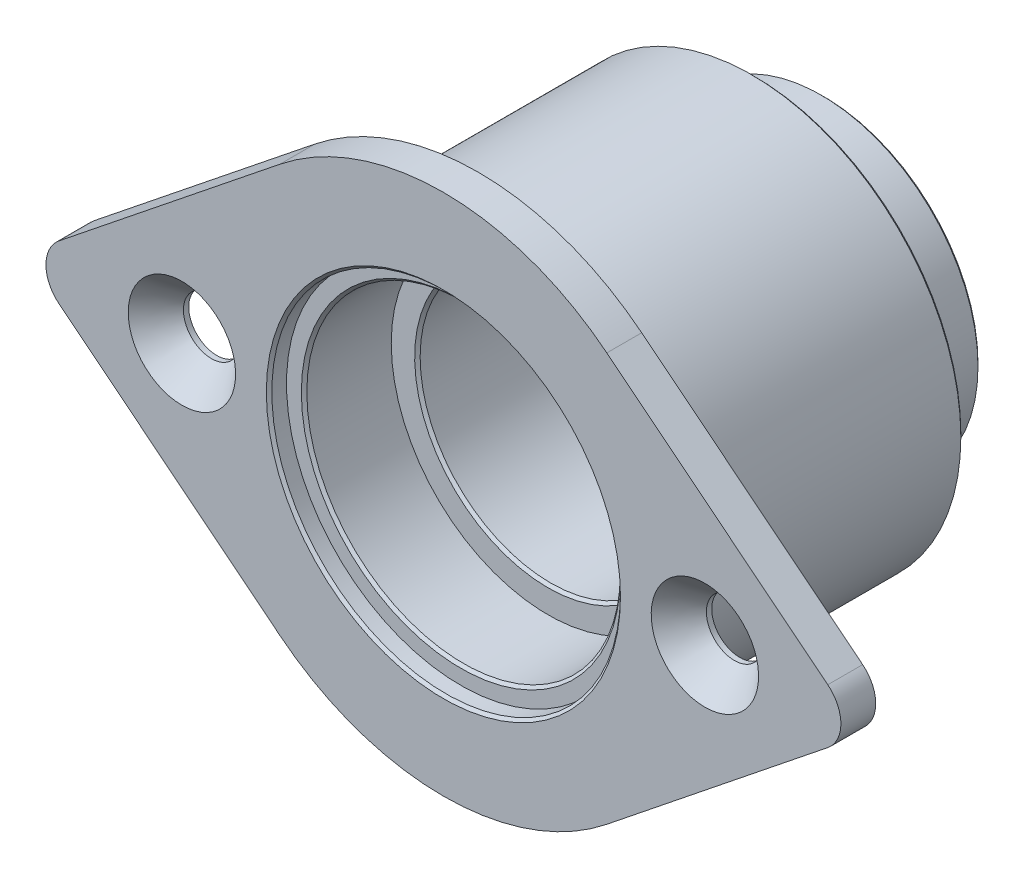
ISO-10303-21;
HEADER;
FILE_DESCRIPTION(('STEP AP214'),'2;1');
FILE_NAME('part.step','',(''),(''),'','','');
FILE_SCHEMA(('AUTOMOTIVE_DESIGN { 1 0 10303 214 1 1 1 1 }'));
ENDSEC;
DATA;
#1=APPLICATION_CONTEXT('core data for automotive mechanical design processes');
#2=APPLICATION_PROTOCOL_DEFINITION('international standard','automotive_design',2000,#1);
#3=PRODUCT_CONTEXT('',#1,'mechanical');
#4=PRODUCT('Part','Part','',(#3));
#5=PRODUCT_RELATED_PRODUCT_CATEGORY('part','',(#4));
#6=PRODUCT_DEFINITION_FORMATION('','',#4);
#7=PRODUCT_DEFINITION_CONTEXT('part definition',#1,'design');
#8=PRODUCT_DEFINITION('design','',#6,#7);
#9=PRODUCT_DEFINITION_SHAPE('','',#8);
#10=(LENGTH_UNIT() NAMED_UNIT(*) SI_UNIT(.MILLI.,.METRE.));
#11=(NAMED_UNIT(*) PLANE_ANGLE_UNIT() SI_UNIT($,.RADIAN.));
#12=(NAMED_UNIT(*) SI_UNIT($,.STERADIAN.) SOLID_ANGLE_UNIT());
#13=UNCERTAINTY_MEASURE_WITH_UNIT(LENGTH_MEASURE(1.E-05),#10,'distance_accuracy_value','');
#14=(GEOMETRIC_REPRESENTATION_CONTEXT(3) GLOBAL_UNCERTAINTY_ASSIGNED_CONTEXT((#13)) GLOBAL_UNIT_ASSIGNED_CONTEXT((#10,
#11,#12)) REPRESENTATION_CONTEXT('',''));
#15=CARTESIAN_POINT('',(0.,0.,0.));
#16=DIRECTION('',(0.,0.,1.));
#17=DIRECTION('',(1.,0.,0.));
#18=AXIS2_PLACEMENT_3D('',#15,#16,#17);
#19=CARTESIAN_POINT('',(0.,0.,-7.9375));
#20=DIRECTION('',(0.,0.,1.));
#21=DIRECTION('',(1.,0.,0.));
#22=AXIS2_PLACEMENT_3D('',#19,#20,#21);
#23=PLANE('',#22);
#24=CARTESIAN_POINT('',(0.,0.,-7.9375));
#25=DIRECTION('',(0.,0.,-1.));
#26=DIRECTION('',(-1.,0.,0.));
#27=AXIS2_PLACEMENT_3D('',#24,#25,#26);
#28=CIRCLE('',#27,14.2748);
#29=CARTESIAN_POINT('',(-14.2748,0.,-7.9375));
#30=VERTEX_POINT('',#29);
#31=EDGE_CURVE('E144',#30,#30,#28,.F.);
#32=ORIENTED_EDGE('',*,*,#31,.T.);
#33=EDGE_LOOP('',(#32));
#34=FACE_BOUND('',#33,.T.);
#35=CARTESIAN_POINT('',(0.,0.,-7.9375));
#36=DIRECTION('',(0.,0.,1.));
#37=DIRECTION('',(0.,-1.,0.));
#38=AXIS2_PLACEMENT_3D('',#35,#36,#37);
#39=CIRCLE('',#38,12.1435499999999);
#40=CARTESIAN_POINT('',(0.,-12.1435499999999,-7.9375));
#41=VERTEX_POINT('',#40);
#42=EDGE_CURVE('E28',#41,#41,#39,.F.);
#43=ORIENTED_EDGE('',*,*,#42,.T.);
#44=EDGE_LOOP('',(#43));
#45=FACE_BOUND('',#44,.T.);
#46=ADVANCED_FACE('F25',(#34,#45),#23,.T.);
#47=CARTESIAN_POINT('',(0.,0.,-7.9375));
#48=DIRECTION('',(0.,0.,1.));
#49=DIRECTION('',(0.,-1.,0.));
#50=AXIS2_PLACEMENT_3D('',#47,#48,#49);
#51=CONICAL_SURFACE('',#50,12.1435499999999,0.785398163397434);
#52=CARTESIAN_POINT('',(0.,0.,-8.18749999999995));
#53=DIRECTION('',(0.,0.,-1.));
#54=DIRECTION('',(-1.,0.,0.));
#55=AXIS2_PLACEMENT_3D('',#52,#53,#54);
#56=CIRCLE('',#55,11.89355);
#57=CARTESIAN_POINT('',(-11.89355,0.,-8.18749999999995));
#58=VERTEX_POINT('',#57);
#59=EDGE_CURVE('E142',#58,#58,#56,.T.);
#60=ORIENTED_EDGE('',*,*,#59,.T.);
#61=EDGE_LOOP('',(#60));
#62=FACE_BOUND('',#61,.T.);
#63=ORIENTED_EDGE('',*,*,#42,.F.);
#64=EDGE_LOOP('',(#63));
#65=FACE_BOUND('',#64,.T.);
#66=ADVANCED_FACE('F203',(#62,#65),#51,.F.);
#67=CARTESIAN_POINT('',(0.,0.,1.5875));
#68=DIRECTION('',(0.,0.,-1.));
#69=DIRECTION('',(-1.,0.,0.));
#70=AXIS2_PLACEMENT_3D('',#67,#68,#69);
#71=CYLINDRICAL_SURFACE('',#70,14.2748);
#72=CARTESIAN_POINT('',(0.,0.,-0.249999999999985));
#73=DIRECTION('',(0.,0.,1.));
#74=DIRECTION('',(1.,0.,0.));
#75=AXIS2_PLACEMENT_3D('',#72,#73,#74);
#76=CIRCLE('',#75,14.2748);
#77=CARTESIAN_POINT('',(14.2748,0.,-0.249999999999985));
#78=VERTEX_POINT('',#77);
#79=EDGE_CURVE('E139',#78,#78,#76,.T.);
#80=ORIENTED_EDGE('',*,*,#79,.T.);
#81=EDGE_LOOP('',(#80));
#82=FACE_BOUND('',#81,.T.);
#83=ORIENTED_EDGE('',*,*,#31,.F.);
#84=EDGE_LOOP('',(#83));
#85=FACE_BOUND('',#84,.T.);
#86=ADVANCED_FACE('F205',(#82,#85),#71,.F.);
#87=CARTESIAN_POINT('',(0.,0.,38.7877315203269));
#88=DIRECTION('',(0.,0.,-1.));
#89=DIRECTION('',(-1.,0.,0.));
#90=AXIS2_PLACEMENT_3D('',#87,#88,#89);
#91=CYLINDRICAL_SURFACE('',#90,11.89355);
#92=ORIENTED_EDGE('',*,*,#59,.F.);
#93=EDGE_LOOP('',(#92));
#94=FACE_BOUND('',#93,.T.);
#95=CARTESIAN_POINT('',(0.,0.,-32.8334999999999));
#96=DIRECTION('',(0.,0.,-1.));
#97=DIRECTION('',(-1.,0.,0.));
#98=AXIS2_PLACEMENT_3D('',#95,#96,#97);
#99=CIRCLE('',#98,11.89355);
#100=CARTESIAN_POINT('',(-11.89355,0.,-32.8334999999999));
#101=VERTEX_POINT('',#100);
#102=EDGE_CURVE('E135',#101,#101,#99,.T.);
#103=ORIENTED_EDGE('',*,*,#102,.T.);
#104=EDGE_LOOP('',(#103));
#105=FACE_BOUND('',#104,.T.);
#106=ADVANCED_FACE('F212',(#94,#105),#91,.F.);
#107=CARTESIAN_POINT('',(0.,0.,0.));
#108=DIRECTION('',(0.,0.,1.));
#109=DIRECTION('',(1.,0.,0.));
#110=AXIS2_PLACEMENT_3D('',#107,#108,#109);
#111=CONICAL_SURFACE('',#110,14.5248,0.785398163397459);
#112=ORIENTED_EDGE('',*,*,#79,.F.);
#113=EDGE_LOOP('',(#112));
#114=FACE_BOUND('',#113,.T.);
#115=CARTESIAN_POINT('',(0.,0.,0.));
#116=DIRECTION('',(0.,0.,1.));
#117=DIRECTION('',(1.,0.,0.));
#118=AXIS2_PLACEMENT_3D('',#115,#116,#117);
#119=CIRCLE('',#118,14.5248);
#120=CARTESIAN_POINT('',(14.5248,0.,0.));
#121=VERTEX_POINT('',#120);
#122=EDGE_CURVE('E138',#121,#121,#119,.F.);
#123=ORIENTED_EDGE('',*,*,#122,.F.);
#124=EDGE_LOOP('',(#123));
#125=FACE_BOUND('',#124,.T.);
#126=ADVANCED_FACE('F309',(#114,#125),#111,.F.);
#127=CARTESIAN_POINT('',(0.,0.,-33.0835));
#128=DIRECTION('',(0.,0.,-1.));
#129=DIRECTION('',(0.,1.,0.));
#130=AXIS2_PLACEMENT_3D('',#127,#128,#129);
#131=CONICAL_SURFACE('',#130,12.1435500000001,0.785398163397448);
#132=ORIENTED_EDGE('',*,*,#102,.F.);
#133=EDGE_LOOP('',(#132));
#134=FACE_BOUND('',#133,.T.);
#135=CARTESIAN_POINT('',(0.,0.,-33.0835));
#136=DIRECTION('',(0.,0.,-1.));
#137=DIRECTION('',(0.,1.,0.));
#138=AXIS2_PLACEMENT_3D('',#135,#136,#137);
#139=CIRCLE('',#138,12.1435500000001);
#140=CARTESIAN_POINT('',(0.,12.1435500000001,-33.0835));
#141=VERTEX_POINT('',#140);
#142=EDGE_CURVE('E192',#141,#141,#139,.F.);
#143=ORIENTED_EDGE('',*,*,#142,.F.);
#144=EDGE_LOOP('',(#143));
#145=FACE_BOUND('',#144,.T.);
#146=ADVANCED_FACE('F305',(#134,#145),#131,.F.);
#147=CARTESIAN_POINT('',(0.,0.,0.));
#148=DIRECTION('',(0.,0.,1.));
#149=DIRECTION('',(1.,0.,0.));
#150=AXIS2_PLACEMENT_3D('',#147,#148,#149);
#151=PLANE('',#150);
#152=CARTESIAN_POINT('',(0.,0.,0.));
#153=DIRECTION('',(0.,0.,1.));
#154=DIRECTION('',(1.,0.,0.));
#155=AXIS2_PLACEMENT_3D('',#152,#153,#154);
#156=CIRCLE('',#155,15.875);
#157=CARTESIAN_POINT('',(15.875,0.,0.));
#158=VERTEX_POINT('',#157);
#159=EDGE_CURVE('E189',#158,#158,#156,.T.);
#160=ORIENTED_EDGE('',*,*,#159,.T.);
#161=EDGE_LOOP('',(#160));
#162=FACE_BOUND('',#161,.T.);
#163=ORIENTED_EDGE('',*,*,#122,.T.);
#164=EDGE_LOOP('',(#163));
#165=FACE_BOUND('',#164,.T.);
#166=ADVANCED_FACE('F301',(#162,#165),#151,.T.);
#167=CARTESIAN_POINT('',(0.,0.,-33.0835));
#168=DIRECTION('',(0.,0.,-1.));
#169=DIRECTION('',(-1.,0.,0.));
#170=AXIS2_PLACEMENT_3D('',#167,#168,#169);
#171=PLANE('',#170);
#172=ORIENTED_EDGE('',*,*,#142,.T.);
#173=EDGE_LOOP('',(#172));
#174=FACE_BOUND('',#173,.T.);
#175=CARTESIAN_POINT('',(0.,0.,-33.0835));
#176=DIRECTION('',(0.,0.,1.));
#177=DIRECTION('',(1.,0.,0.));
#178=AXIS2_PLACEMENT_3D('',#175,#176,#177);
#179=CIRCLE('',#178,14.0121);
#180=CARTESIAN_POINT('',(14.0121,0.,-33.0835));
#181=VERTEX_POINT('',#180);
#182=EDGE_CURVE('E134',#181,#181,#179,.T.);
#183=ORIENTED_EDGE('',*,*,#182,.F.);
#184=EDGE_LOOP('',(#183));
#185=FACE_BOUND('',#184,.T.);
#186=ADVANCED_FACE('F297',(#174,#185),#171,.T.);
#187=CARTESIAN_POINT('',(0.,0.,0.));
#188=DIRECTION('',(0.,0.,1.));
#189=DIRECTION('',(1.,0.,0.));
#190=AXIS2_PLACEMENT_3D('',#187,#188,#189);
#191=CYLINDRICAL_SURFACE('',#190,15.875);
#192=ORIENTED_EDGE('',*,*,#159,.F.);
#193=EDGE_LOOP('',(#192));
#194=FACE_BOUND('',#193,.T.);
#195=CARTESIAN_POINT('',(0.,0.,1.3375));
#196=DIRECTION('',(0.,0.,1.));
#197=DIRECTION('',(1.,0.,0.));
#198=AXIS2_PLACEMENT_3D('',#195,#196,#197);
#199=CIRCLE('',#198,15.875);
#200=CARTESIAN_POINT('',(15.875,0.,1.3375));
#201=VERTEX_POINT('',#200);
#202=EDGE_CURVE('E131',#201,#201,#199,.T.);
#203=ORIENTED_EDGE('',*,*,#202,.T.);
#204=EDGE_LOOP('',(#203));
#205=FACE_BOUND('',#204,.T.);
#206=ADVANCED_FACE('F293',(#194,#205),#191,.F.);
#207=CARTESIAN_POINT('',(0.,0.,-32.8335));
#208=DIRECTION('',(0.,0.,1.));
#209=DIRECTION('',(1.,0.,0.));
#210=AXIS2_PLACEMENT_3D('',#207,#208,#209);
#211=CONICAL_SURFACE('',#210,14.2621,0.785398163397424);
#212=CARTESIAN_POINT('',(0.,0.,-32.8335));
#213=DIRECTION('',(0.,0.,-1.));
#214=DIRECTION('',(-1.,0.,0.));
#215=AXIS2_PLACEMENT_3D('',#212,#213,#214);
#216=CIRCLE('',#215,14.2621);
#217=CARTESIAN_POINT('',(-14.2621,0.,-32.8335));
#218=VERTEX_POINT('',#217);
#219=EDGE_CURVE('E127',#218,#218,#216,.F.);
#220=ORIENTED_EDGE('',*,*,#219,.F.);
#221=EDGE_LOOP('',(#220));
#222=FACE_BOUND('',#221,.T.);
#223=ORIENTED_EDGE('',*,*,#182,.T.);
#224=EDGE_LOOP('',(#223));
#225=FACE_BOUND('',#224,.T.);
#226=ADVANCED_FACE('F289',(#222,#225),#211,.T.);
#227=CARTESIAN_POINT('',(0.,0.,1.5875));
#228=DIRECTION('',(0.,0.,1.));
#229=DIRECTION('',(1.,0.,0.));
#230=AXIS2_PLACEMENT_3D('',#227,#228,#229);
#231=CONICAL_SURFACE('',#230,16.125,0.785398163397476);
#232=ORIENTED_EDGE('',*,*,#202,.F.);
#233=EDGE_LOOP('',(#232));
#234=FACE_BOUND('',#233,.T.);
#235=CARTESIAN_POINT('',(0.,0.,1.5875));
#236=DIRECTION('',(0.,0.,1.));
#237=DIRECTION('',(1.,0.,0.));
#238=AXIS2_PLACEMENT_3D('',#235,#236,#237);
#239=CIRCLE('',#238,16.125);
#240=CARTESIAN_POINT('',(16.125,0.,1.5875));
#241=VERTEX_POINT('',#240);
#242=EDGE_CURVE('E130',#241,#241,#239,.F.);
#243=ORIENTED_EDGE('',*,*,#242,.F.);
#244=EDGE_LOOP('',(#243));
#245=FACE_BOUND('',#244,.T.);
#246=ADVANCED_FACE('F285',(#234,#245),#231,.F.);
#247=CARTESIAN_POINT('',(0.,0.,27.1480367264149));
#248=DIRECTION('',(0.,0.,-1.));
#249=DIRECTION('',(-1.,0.,0.));
#250=AXIS2_PLACEMENT_3D('',#247,#248,#249);
#251=CYLINDRICAL_SURFACE('',#250,14.2621);
#252=ORIENTED_EDGE('',*,*,#219,.T.);
#253=EDGE_LOOP('',(#252));
#254=FACE_BOUND('',#253,.T.);
#255=CARTESIAN_POINT('',(0.,0.,-26.7335));
#256=DIRECTION('',(0.,0.,-1.));
#257=DIRECTION('',(-1.,0.,0.));
#258=AXIS2_PLACEMENT_3D('',#255,#256,#257);
#259=CIRCLE('',#258,14.2621);
#260=CARTESIAN_POINT('',(-14.2621,0.,-26.7335));
#261=VERTEX_POINT('',#260);
#262=EDGE_CURVE('E126',#261,#261,#259,.F.);
#263=ORIENTED_EDGE('',*,*,#262,.F.);
#264=EDGE_LOOP('',(#263));
#265=FACE_BOUND('',#264,.T.);
#266=ADVANCED_FACE('F281',(#254,#265),#251,.T.);
#267=CARTESIAN_POINT('',(-23.8125,0.,1.58749999997099));
#268=DIRECTION('',(0.,0.,1.));
#269=DIRECTION('',(0.,-1.,0.));
#270=AXIS2_PLACEMENT_3D('',#267,#268,#269);
#271=CONICAL_SURFACE('',#270,4.88949999997067,0.71558499333661);
#272=CARTESIAN_POINT('',(-23.8125,0.,-1.10068089399406));
#273=DIRECTION('',(0.,0.,1.));
#274=DIRECTION('',(1.,0.,0.));
#275=AXIS2_PLACEMENT_3D('',#272,#273,#274);
#276=CIRCLE('',#275,2.5527);
#277=CARTESIAN_POINT('',(-21.2598,0.,-1.10068089399406));
#278=VERTEX_POINT('',#277);
#279=EDGE_CURVE('E123',#278,#278,#276,.F.);
#280=ORIENTED_EDGE('',*,*,#279,.T.);
#281=EDGE_LOOP('',(#280));
#282=FACE_BOUND('',#281,.T.);
#283=CARTESIAN_POINT('',(-23.8125,0.,1.58749999997099));
#284=DIRECTION('',(0.,0.,1.));
#285=DIRECTION('',(0.,-1.,0.));
#286=AXIS2_PLACEMENT_3D('',#283,#284,#285);
#287=CIRCLE('',#286,4.88949999997067);
#288=CARTESIAN_POINT('',(-23.8125,-4.88949999997067,1.58749999997099));
#289=VERTEX_POINT('',#288);
#290=EDGE_CURVE('E182',#289,#289,#287,.F.);
#291=ORIENTED_EDGE('',*,*,#290,.F.);
#292=EDGE_LOOP('',(#291));
#293=FACE_BOUND('',#292,.T.);
#294=ADVANCED_FACE('F277',(#282,#293),#271,.F.);
#295=CARTESIAN_POINT('',(23.8125,0.,1.58749999997099));
#296=DIRECTION('',(0.,0.,1.));
#297=DIRECTION('',(0.,-1.,0.));
#298=AXIS2_PLACEMENT_3D('',#295,#296,#297);
#299=CONICAL_SURFACE('',#298,4.88949999995293,0.71558499333661);
#300=CARTESIAN_POINT('',(23.8125,0.,-1.10068089399406));
#301=DIRECTION('',(0.,0.,1.));
#302=DIRECTION('',(1.,0.,0.));
#303=AXIS2_PLACEMENT_3D('',#300,#301,#302);
#304=CIRCLE('',#303,2.5527);
#305=CARTESIAN_POINT('',(26.3652,0.,-1.10068089399406));
#306=VERTEX_POINT('',#305);
#307=EDGE_CURVE('E101',#306,#306,#304,.F.);
#308=ORIENTED_EDGE('',*,*,#307,.T.);
#309=EDGE_LOOP('',(#308));
#310=FACE_BOUND('',#309,.T.);
#311=CARTESIAN_POINT('',(23.8125,0.,1.58749999997099));
#312=DIRECTION('',(0.,0.,1.));
#313=DIRECTION('',(0.,-1.,0.));
#314=AXIS2_PLACEMENT_3D('',#311,#312,#313);
#315=CIRCLE('',#314,4.88949999995293);
#316=CARTESIAN_POINT('',(23.8125,-4.88949999995292,1.58749999997099));
#317=VERTEX_POINT('',#316);
#318=EDGE_CURVE('E179',#317,#317,#315,.F.);
#319=ORIENTED_EDGE('',*,*,#318,.F.);
#320=EDGE_LOOP('',(#319));
#321=FACE_BOUND('',#320,.T.);
#322=ADVANCED_FACE('F274',(#310,#321),#299,.F.);
#323=CARTESIAN_POINT('',(0.,0.,1.5875));
#324=DIRECTION('',(0.,0.,1.));
#325=DIRECTION('',(1.,0.,0.));
#326=AXIS2_PLACEMENT_3D('',#323,#324,#325);
#327=PLANE('',#326);
#328=DIRECTION('',(-0.7806247497998,0.625,0.));
#329=VECTOR('',#328,1.);
#330=CARTESIAN_POINT('',(-14.8828125,-18.5886268546077,1.5875));
#331=LINE('',#330,#329);
#332=CARTESIAN_POINT('',(-35.004375,-2.47848358061436,1.5875));
#333=VERTEX_POINT('',#332);
#334=CARTESIAN_POINT('',(-14.8828125,-18.5886268546077,1.5875));
#335=VERTEX_POINT('',#334);
#336=EDGE_CURVE('E119',#333,#335,#331,.F.);
#337=ORIENTED_EDGE('',*,*,#336,.T.);
#338=CARTESIAN_POINT('',(0.,0.,1.5875));
#339=DIRECTION('',(0.,0.,-1.));
#340=DIRECTION('',(-1.,0.,0.));
#341=AXIS2_PLACEMENT_3D('',#338,#339,#340);
#342=CIRCLE('',#341,23.8125);
#343=CARTESIAN_POINT('',(14.8828125,-18.5886268546077,1.5875));
#344=VERTEX_POINT('',#343);
#345=EDGE_CURVE('E171',#344,#335,#342,.T.);
#346=ORIENTED_EDGE('',*,*,#345,.F.);
#347=DIRECTION('',(0.7806247497998,0.625,0.));
#348=VECTOR('',#347,1.);
#349=CARTESIAN_POINT('',(14.8828125,-18.5886268546077,1.5875));
#350=LINE('',#349,#348);
#351=CARTESIAN_POINT('',(35.004375,-2.47848358061437,1.5875));
#352=VERTEX_POINT('',#351);
#353=EDGE_CURVE('E535',#352,#344,#350,.F.);
#354=ORIENTED_EDGE('',*,*,#353,.F.);
#355=CARTESIAN_POINT('',(33.02,0.,1.5875));
#356=DIRECTION('',(0.,0.,-1.));
#357=DIRECTION('',(-1.,0.,0.));
#358=AXIS2_PLACEMENT_3D('',#355,#356,#357);
#359=CIRCLE('',#358,3.175);
#360=CARTESIAN_POINT('',(35.004375,2.47848358061436,1.5875));
#361=VERTEX_POINT('',#360);
#362=EDGE_CURVE('E166',#361,#352,#359,.T.);
#363=ORIENTED_EDGE('',*,*,#362,.F.);
#364=DIRECTION('',(-0.7806247497998,0.625,0.));
#365=VECTOR('',#364,1.);
#366=CARTESIAN_POINT('',(14.8828125,18.5886268546077,1.5875));
#367=LINE('',#366,#365);
#368=CARTESIAN_POINT('',(14.8828125,18.5886268546077,1.5875));
#369=VERTEX_POINT('',#368);
#370=EDGE_CURVE('E97',#369,#361,#367,.F.);
#371=ORIENTED_EDGE('',*,*,#370,.F.);
#372=CARTESIAN_POINT('',(0.,0.,1.5875));
#373=DIRECTION('',(0.,0.,-1.));
#374=DIRECTION('',(-1.,0.,0.));
#375=AXIS2_PLACEMENT_3D('',#372,#373,#374);
#376=CIRCLE('',#375,23.8125);
#377=CARTESIAN_POINT('',(-14.8828125,18.5886268546077,1.5875));
#378=VERTEX_POINT('',#377);
#379=EDGE_CURVE('E89',#378,#369,#376,.T.);
#380=ORIENTED_EDGE('',*,*,#379,.F.);
#381=DIRECTION('',(0.7806247497998,0.625,0.));
#382=VECTOR('',#381,1.);
#383=CARTESIAN_POINT('',(-14.8828125,18.5886268546077,1.5875));
#384=LINE('',#383,#382);
#385=CARTESIAN_POINT('',(-35.004375,2.47848358061436,1.5875));
#386=VERTEX_POINT('',#385);
#387=EDGE_CURVE('E94',#378,#386,#384,.F.);
#388=ORIENTED_EDGE('',*,*,#387,.T.);
#389=CARTESIAN_POINT('',(-33.02,0.,1.5875));
#390=DIRECTION('',(0.,0.,-1.));
#391=DIRECTION('',(-1.,0.,0.));
#392=AXIS2_PLACEMENT_3D('',#389,#390,#391);
#393=CIRCLE('',#392,3.175);
#394=EDGE_CURVE('E115',#333,#386,#393,.T.);
#395=ORIENTED_EDGE('',*,*,#394,.F.);
#396=EDGE_LOOP('',(#337,#346,#354,#363,#371,#380,#388,#395));
#397=FACE_BOUND('',#396,.T.);
#398=ORIENTED_EDGE('',*,*,#318,.T.);
#399=EDGE_LOOP('',(#398));
#400=FACE_BOUND('',#399,.T.);
#401=ORIENTED_EDGE('',*,*,#290,.T.);
#402=EDGE_LOOP('',(#401));
#403=FACE_BOUND('',#402,.T.);
#404=ORIENTED_EDGE('',*,*,#242,.T.);
#405=EDGE_LOOP('',(#404));
#406=FACE_BOUND('',#405,.T.);
#407=ADVANCED_FACE('F91',(#397,#400,#403,#406),#327,.T.);
#408=CARTESIAN_POINT('',(0.,0.,-26.7335));
#409=DIRECTION('',(0.,0.,-1.));
#410=DIRECTION('',(-1.,0.,0.));
#411=AXIS2_PLACEMENT_3D('',#408,#409,#410);
#412=PLANE('',#411);
#413=ORIENTED_EDGE('',*,*,#262,.T.);
#414=EDGE_LOOP('',(#413));
#415=FACE_BOUND('',#414,.T.);
#416=CARTESIAN_POINT('',(0.,0.,-26.7335));
#417=DIRECTION('',(0.,0.,1.));
#418=DIRECTION('',(1.,0.,0.));
#419=AXIS2_PLACEMENT_3D('',#416,#417,#418);
#420=CIRCLE('',#419,18.8);
#421=CARTESIAN_POINT('',(18.8,0.,-26.7335));
#422=VERTEX_POINT('',#421);
#423=EDGE_CURVE('E162',#422,#422,#420,.T.);
#424=ORIENTED_EDGE('',*,*,#423,.F.);
#425=EDGE_LOOP('',(#424));
#426=FACE_BOUND('',#425,.T.);
#427=ADVANCED_FACE('F267',(#415,#426),#412,.T.);
#428=CARTESIAN_POINT('',(-23.8125,0.,1.5875));
#429=DIRECTION('',(0.,0.,1.));
#430=DIRECTION('',(1.,0.,0.));
#431=AXIS2_PLACEMENT_3D('',#428,#429,#430);
#432=CYLINDRICAL_SURFACE('',#431,2.5527);
#433=CARTESIAN_POINT('',(-23.8125,0.,-1.5875));
#434=DIRECTION('',(0.,0.,1.));
#435=DIRECTION('',(1.,0.,0.));
#436=AXIS2_PLACEMENT_3D('',#433,#434,#435);
#437=CIRCLE('',#436,2.5527);
#438=CARTESIAN_POINT('',(-21.2598,0.,-1.5875));
#439=VERTEX_POINT('',#438);
#440=EDGE_CURVE('E159',#439,#439,#437,.F.);
#441=ORIENTED_EDGE('',*,*,#440,.T.);
#442=EDGE_LOOP('',(#441));
#443=FACE_BOUND('',#442,.T.);
#444=ORIENTED_EDGE('',*,*,#279,.F.);
#445=EDGE_LOOP('',(#444));
#446=FACE_BOUND('',#445,.T.);
#447=ADVANCED_FACE('F263',(#443,#446),#432,.F.);
#448=CARTESIAN_POINT('',(23.8125,0.,1.5875));
#449=DIRECTION('',(0.,0.,1.));
#450=DIRECTION('',(1.,0.,0.));
#451=AXIS2_PLACEMENT_3D('',#448,#449,#450);
#452=CYLINDRICAL_SURFACE('',#451,2.5527);
#453=CARTESIAN_POINT('',(23.8125,0.,-1.5875));
#454=DIRECTION('',(0.,0.,1.));
#455=DIRECTION('',(1.,0.,0.));
#456=AXIS2_PLACEMENT_3D('',#453,#454,#455);
#457=CIRCLE('',#456,2.5527);
#458=CARTESIAN_POINT('',(26.3652,0.,-1.5875));
#459=VERTEX_POINT('',#458);
#460=EDGE_CURVE('E156',#459,#459,#457,.F.);
#461=ORIENTED_EDGE('',*,*,#460,.T.);
#462=EDGE_LOOP('',(#461));
#463=FACE_BOUND('',#462,.T.);
#464=ORIENTED_EDGE('',*,*,#307,.F.);
#465=EDGE_LOOP('',(#464));
#466=FACE_BOUND('',#465,.T.);
#467=ADVANCED_FACE('F260',(#463,#466),#452,.F.);
#468=CARTESIAN_POINT('',(0.,0.,1.5875));
#469=DIRECTION('',(0.,0.,-1.));
#470=DIRECTION('',(-1.,0.,0.));
#471=AXIS2_PLACEMENT_3D('',#468,#469,#470);
#472=CYLINDRICAL_SURFACE('',#471,23.8125);
#473=ORIENTED_EDGE('',*,*,#379,.T.);
#474=DIRECTION('',(0.,0.,1.));
#475=VECTOR('',#474,1.);
#476=CARTESIAN_POINT('',(14.8828125,18.5886268546077,1.5875));
#477=LINE('',#476,#475);
#478=CARTESIAN_POINT('',(14.8828125,18.5886268546077,-1.5875));
#479=VERTEX_POINT('',#478);
#480=EDGE_CURVE('E165',#479,#369,#477,.T.);
#481=ORIENTED_EDGE('',*,*,#480,.F.);
#482=CARTESIAN_POINT('',(0.,0.,-1.5875));
#483=DIRECTION('',(0.,0.,-1.));
#484=DIRECTION('',(-1.,0.,0.));
#485=AXIS2_PLACEMENT_3D('',#482,#483,#484);
#486=CIRCLE('',#485,23.8125);
#487=CARTESIAN_POINT('',(-14.8828125,18.5886268546077,-1.5875));
#488=VERTEX_POINT('',#487);
#489=EDGE_CURVE('E106',#479,#488,#486,.F.);
#490=ORIENTED_EDGE('',*,*,#489,.T.);
#491=DIRECTION('',(0.,0.,1.));
#492=VECTOR('',#491,1.);
#493=CARTESIAN_POINT('',(-14.8828125,18.5886268546077,1.5875));
#494=LINE('',#493,#492);
#495=EDGE_CURVE('E100',#488,#378,#494,.T.);
#496=ORIENTED_EDGE('',*,*,#495,.T.);
#497=EDGE_LOOP('',(#473,#481,#490,#496));
#498=FACE_BOUND('',#497,.T.);
#499=ADVANCED_FACE('F104',(#498),#472,.T.);
#500=CARTESIAN_POINT('',(-14.8828125,18.5886268546077,1.5875));
#501=DIRECTION('',(0.625,-0.7806247497998,0.));
#502=DIRECTION('',(0.7806247497998,0.625,0.));
#503=AXIS2_PLACEMENT_3D('',#500,#501,#502);
#504=PLANE('',#503);
#505=DIRECTION('',(0.,0.,-1.));
#506=VECTOR('',#505,1.);
#507=CARTESIAN_POINT('',(-35.004375,2.47848358061435,1.5875));
#508=LINE('',#507,#506);
#509=CARTESIAN_POINT('',(-35.004375,2.47848358061436,-1.5875));
#510=VERTEX_POINT('',#509);
#511=EDGE_CURVE('E113',#386,#510,#508,.T.);
#512=ORIENTED_EDGE('',*,*,#511,.F.);
#513=ORIENTED_EDGE('',*,*,#387,.F.);
#514=ORIENTED_EDGE('',*,*,#495,.F.);
#515=DIRECTION('',(-0.7806247497998,-0.625,0.));
#516=VECTOR('',#515,1.);
#517=CARTESIAN_POINT('',(-14.8828125,18.5886268546077,-1.5875));
#518=LINE('',#517,#516);
#519=EDGE_CURVE('E154',#488,#510,#518,.T.);
#520=ORIENTED_EDGE('',*,*,#519,.T.);
#521=EDGE_LOOP('',(#512,#513,#514,#520));
#522=FACE_BOUND('',#521,.T.);
#523=ADVANCED_FACE('F111',(#522),#504,.F.);
#524=CARTESIAN_POINT('',(-33.02,0.,1.5875));
#525=DIRECTION('',(0.,0.,-1.));
#526=DIRECTION('',(-1.,0.,0.));
#527=AXIS2_PLACEMENT_3D('',#524,#525,#526);
#528=CYLINDRICAL_SURFACE('',#527,3.175);
#529=CARTESIAN_POINT('',(-33.02,0.,-1.5875));
#530=DIRECTION('',(0.,0.,-1.));
#531=DIRECTION('',(-1.,0.,0.));
#532=AXIS2_PLACEMENT_3D('',#529,#530,#531);
#533=CIRCLE('',#532,3.175);
#534=CARTESIAN_POINT('',(-35.004375,-2.47848358061437,-1.5875));
#535=VERTEX_POINT('',#534);
#536=EDGE_CURVE('E152',#510,#535,#533,.F.);
#537=ORIENTED_EDGE('',*,*,#536,.T.);
#538=DIRECTION('',(0.,0.,1.));
#539=VECTOR('',#538,1.);
#540=CARTESIAN_POINT('',(-35.004375,-2.47848358061437,1.5875));
#541=LINE('',#540,#539);
#542=EDGE_CURVE('E175',#535,#333,#541,.T.);
#543=ORIENTED_EDGE('',*,*,#542,.T.);
#544=ORIENTED_EDGE('',*,*,#394,.T.);
#545=ORIENTED_EDGE('',*,*,#511,.T.);
#546=EDGE_LOOP('',(#537,#543,#544,#545));
#547=FACE_BOUND('',#546,.T.);
#548=ADVANCED_FACE('F251',(#547),#528,.T.);
#549=CARTESIAN_POINT('',(-14.8828125,-18.5886268546077,1.5875));
#550=DIRECTION('',(0.625,0.7806247497998,0.));
#551=DIRECTION('',(-0.7806247497998,0.625,0.));
#552=AXIS2_PLACEMENT_3D('',#549,#550,#551);
#553=PLANE('',#552);
#554=ORIENTED_EDGE('',*,*,#542,.F.);
#555=DIRECTION('',(0.7806247497998,-0.625,0.));
#556=VECTOR('',#555,1.);
#557=CARTESIAN_POINT('',(-35.004375,-2.47848358061437,-1.5875));
#558=LINE('',#557,#556);
#559=CARTESIAN_POINT('',(-14.8828125,-18.5886268546077,-1.5875));
#560=VERTEX_POINT('',#559);
#561=EDGE_CURVE('E151',#535,#560,#558,.T.);
#562=ORIENTED_EDGE('',*,*,#561,.T.);
#563=DIRECTION('',(0.,0.,-1.));
#564=VECTOR('',#563,1.);
#565=CARTESIAN_POINT('',(-14.8828125,-18.5886268546077,1.5875));
#566=LINE('',#565,#564);
#567=EDGE_CURVE('E174',#335,#560,#566,.T.);
#568=ORIENTED_EDGE('',*,*,#567,.F.);
#569=ORIENTED_EDGE('',*,*,#336,.F.);
#570=EDGE_LOOP('',(#554,#562,#568,#569));
#571=FACE_BOUND('',#570,.T.);
#572=ADVANCED_FACE('F247',(#571),#553,.F.);
#573=CARTESIAN_POINT('',(0.,0.,1.5875));
#574=DIRECTION('',(0.,0.,-1.));
#575=DIRECTION('',(-1.,0.,0.));
#576=AXIS2_PLACEMENT_3D('',#573,#574,#575);
#577=CYLINDRICAL_SURFACE('',#576,23.8125);
#578=ORIENTED_EDGE('',*,*,#345,.T.);
#579=ORIENTED_EDGE('',*,*,#567,.T.);
#580=CARTESIAN_POINT('',(0.,0.,-1.5875));
#581=DIRECTION('',(0.,0.,-1.));
#582=DIRECTION('',(-1.,0.,0.));
#583=AXIS2_PLACEMENT_3D('',#580,#581,#582);
#584=CIRCLE('',#583,23.8125);
#585=CARTESIAN_POINT('',(14.8828125,-18.5886268546077,-1.5875));
#586=VERTEX_POINT('',#585);
#587=EDGE_CURVE('E149',#560,#586,#584,.F.);
#588=ORIENTED_EDGE('',*,*,#587,.T.);
#589=DIRECTION('',(0.,0.,1.));
#590=VECTOR('',#589,1.);
#591=CARTESIAN_POINT('',(14.8828125,-18.5886268546077,1.5875));
#592=LINE('',#591,#590);
#593=EDGE_CURVE('E170',#344,#586,#592,.F.);
#594=ORIENTED_EDGE('',*,*,#593,.F.);
#595=EDGE_LOOP('',(#578,#579,#588,#594));
#596=FACE_BOUND('',#595,.T.);
#597=ADVANCED_FACE('F243',(#596),#577,.T.);
#598=CARTESIAN_POINT('',(14.8828125,-18.5886268546077,1.5875));
#599=DIRECTION('',(0.625,-0.7806247497998,0.));
#600=DIRECTION('',(0.7806247497998,0.625,0.));
#601=AXIS2_PLACEMENT_3D('',#598,#599,#600);
#602=PLANE('',#601);
#603=ORIENTED_EDGE('',*,*,#353,.T.);
#604=ORIENTED_EDGE('',*,*,#593,.T.);
#605=DIRECTION('',(0.7806247497998,0.625,0.));
#606=VECTOR('',#605,1.);
#607=CARTESIAN_POINT('',(14.8828125,-18.5886268546077,-1.5875));
#608=LINE('',#607,#606);
#609=CARTESIAN_POINT('',(35.004375,-2.47848358061437,-1.5875));
#610=VERTEX_POINT('',#609);
#611=EDGE_CURVE('E148',#586,#610,#608,.T.);
#612=ORIENTED_EDGE('',*,*,#611,.T.);
#613=DIRECTION('',(0.,0.,-1.));
#614=VECTOR('',#613,1.);
#615=CARTESIAN_POINT('',(35.004375,-2.47848358061437,1.5875));
#616=LINE('',#615,#614);
#617=EDGE_CURVE('E169',#352,#610,#616,.T.);
#618=ORIENTED_EDGE('',*,*,#617,.F.);
#619=EDGE_LOOP('',(#603,#604,#612,#618));
#620=FACE_BOUND('',#619,.T.);
#621=ADVANCED_FACE('F240',(#620),#602,.T.);
#622=CARTESIAN_POINT('',(33.02,0.,1.5875));
#623=DIRECTION('',(0.,0.,-1.));
#624=DIRECTION('',(-1.,0.,0.));
#625=AXIS2_PLACEMENT_3D('',#622,#623,#624);
#626=CYLINDRICAL_SURFACE('',#625,3.175);
#627=CARTESIAN_POINT('',(33.02,0.,-1.5875));
#628=DIRECTION('',(0.,0.,-1.));
#629=DIRECTION('',(-1.,0.,0.));
#630=AXIS2_PLACEMENT_3D('',#627,#628,#629);
#631=CIRCLE('',#630,3.175);
#632=CARTESIAN_POINT('',(35.004375,2.47848358061436,-1.5875));
#633=VERTEX_POINT('',#632);
#634=EDGE_CURVE('E43',#610,#633,#631,.F.);
#635=ORIENTED_EDGE('',*,*,#634,.T.);
#636=DIRECTION('',(0.,0.,1.));
#637=VECTOR('',#636,1.);
#638=CARTESIAN_POINT('',(35.004375,2.47848358061436,1.5875));
#639=LINE('',#638,#637);
#640=EDGE_CURVE('E529',#361,#633,#639,.F.);
#641=ORIENTED_EDGE('',*,*,#640,.F.);
#642=ORIENTED_EDGE('',*,*,#362,.T.);
#643=ORIENTED_EDGE('',*,*,#617,.T.);
#644=EDGE_LOOP('',(#635,#641,#642,#643));
#645=FACE_BOUND('',#644,.T.);
#646=ADVANCED_FACE('F236',(#645),#626,.T.);
#647=CARTESIAN_POINT('',(14.8828125,18.5886268546077,1.5875));
#648=DIRECTION('',(0.625,0.7806247497998,0.));
#649=DIRECTION('',(-0.7806247497998,0.625,0.));
#650=AXIS2_PLACEMENT_3D('',#647,#648,#649);
#651=PLANE('',#650);
#652=DIRECTION('',(-0.7806247497998,0.625,0.));
#653=VECTOR('',#652,1.);
#654=CARTESIAN_POINT('',(35.004375,2.47848358061437,-1.5875));
#655=LINE('',#654,#653);
#656=EDGE_CURVE('E147',#633,#479,#655,.T.);
#657=ORIENTED_EDGE('',*,*,#656,.T.);
#658=ORIENTED_EDGE('',*,*,#480,.T.);
#659=ORIENTED_EDGE('',*,*,#370,.T.);
#660=ORIENTED_EDGE('',*,*,#640,.T.);
#661=EDGE_LOOP('',(#657,#658,#659,#660));
#662=FACE_BOUND('',#661,.T.);
#663=ADVANCED_FACE('F232',(#662),#651,.T.);
#664=CARTESIAN_POINT('',(0.,0.,-26.4835));
#665=DIRECTION('',(0.,0.,1.));
#666=DIRECTION('',(1.,0.,0.));
#667=AXIS2_PLACEMENT_3D('',#664,#665,#666);
#668=CONICAL_SURFACE('',#667,19.05,0.785398163397434);
#669=ORIENTED_EDGE('',*,*,#423,.T.);
#670=EDGE_LOOP('',(#669));
#671=FACE_BOUND('',#670,.T.);
#672=CARTESIAN_POINT('',(0.,0.,-26.4835));
#673=DIRECTION('',(0.,0.,1.));
#674=DIRECTION('',(1.,0.,0.));
#675=AXIS2_PLACEMENT_3D('',#672,#673,#674);
#676=CIRCLE('',#675,19.05);
#677=CARTESIAN_POINT('',(19.05,0.,-26.4835));
#678=VERTEX_POINT('',#677);
#679=EDGE_CURVE('E34',#678,#678,#676,.T.);
#680=ORIENTED_EDGE('',*,*,#679,.F.);
#681=EDGE_LOOP('',(#680));
#682=FACE_BOUND('',#681,.T.);
#683=ADVANCED_FACE('F224',(#671,#682),#668,.T.);
#684=CARTESIAN_POINT('',(0.,0.,-1.5875));
#685=DIRECTION('',(0.,0.,1.));
#686=DIRECTION('',(1.,0.,0.));
#687=AXIS2_PLACEMENT_3D('',#684,#685,#686);
#688=PLANE('',#687);
#689=CARTESIAN_POINT('',(0.,0.,-1.5875));
#690=DIRECTION('',(0.,0.,1.));
#691=DIRECTION('',(1.,0.,0.));
#692=AXIS2_PLACEMENT_3D('',#689,#690,#691);
#693=CIRCLE('',#692,19.05);
#694=CARTESIAN_POINT('',(19.05,0.,-1.5875));
#695=VERTEX_POINT('',#694);
#696=EDGE_CURVE('E13',#695,#695,#693,.F.);
#697=ORIENTED_EDGE('',*,*,#696,.F.);
#698=EDGE_LOOP('',(#697));
#699=FACE_BOUND('',#698,.T.);
#700=ORIENTED_EDGE('',*,*,#634,.F.);
#701=ORIENTED_EDGE('',*,*,#611,.F.);
#702=ORIENTED_EDGE('',*,*,#587,.F.);
#703=ORIENTED_EDGE('',*,*,#561,.F.);
#704=ORIENTED_EDGE('',*,*,#536,.F.);
#705=ORIENTED_EDGE('',*,*,#519,.F.);
#706=ORIENTED_EDGE('',*,*,#489,.F.);
#707=ORIENTED_EDGE('',*,*,#656,.F.);
#708=EDGE_LOOP('',(#700,#701,#702,#703,#704,#705,#706,#707));
#709=FACE_BOUND('',#708,.T.);
#710=ORIENTED_EDGE('',*,*,#460,.F.);
#711=EDGE_LOOP('',(#710));
#712=FACE_BOUND('',#711,.T.);
#713=ORIENTED_EDGE('',*,*,#440,.F.);
#714=EDGE_LOOP('',(#713));
#715=FACE_BOUND('',#714,.T.);
#716=ADVANCED_FACE('F218',(#699,#709,#712,#715),#688,.F.);
#717=CARTESIAN_POINT('',(0.,0.,-26.7335));
#718=DIRECTION('',(0.,0.,1.));
#719=DIRECTION('',(1.,0.,0.));
#720=AXIS2_PLACEMENT_3D('',#717,#718,#719);
#721=CYLINDRICAL_SURFACE('',#720,19.05);
#722=ORIENTED_EDGE('',*,*,#679,.T.);
#723=EDGE_LOOP('',(#722));
#724=FACE_BOUND('',#723,.T.);
#725=ORIENTED_EDGE('',*,*,#696,.T.);
#726=EDGE_LOOP('',(#725));
#727=FACE_BOUND('',#726,.T.);
#728=ADVANCED_FACE('F216',(#724,#727),#721,.T.);
#729=CLOSED_SHELL('',(#46,#66,#86,#106,#126,#146,#166,#186,#206,#226,#246,#266,#294,#322,#407,
#427,#447,#467,#499,#523,#548,#572,#597,#621,#646,#663,#683,#716,#728));
#730=MANIFOLD_SOLID_BREP('B1',#729);
#731=ADVANCED_BREP_SHAPE_REPRESENTATION('',(#18,#730),#14);
#732=SHAPE_DEFINITION_REPRESENTATION(#9,#731);
ENDSEC;
END-ISO-10303-21;
